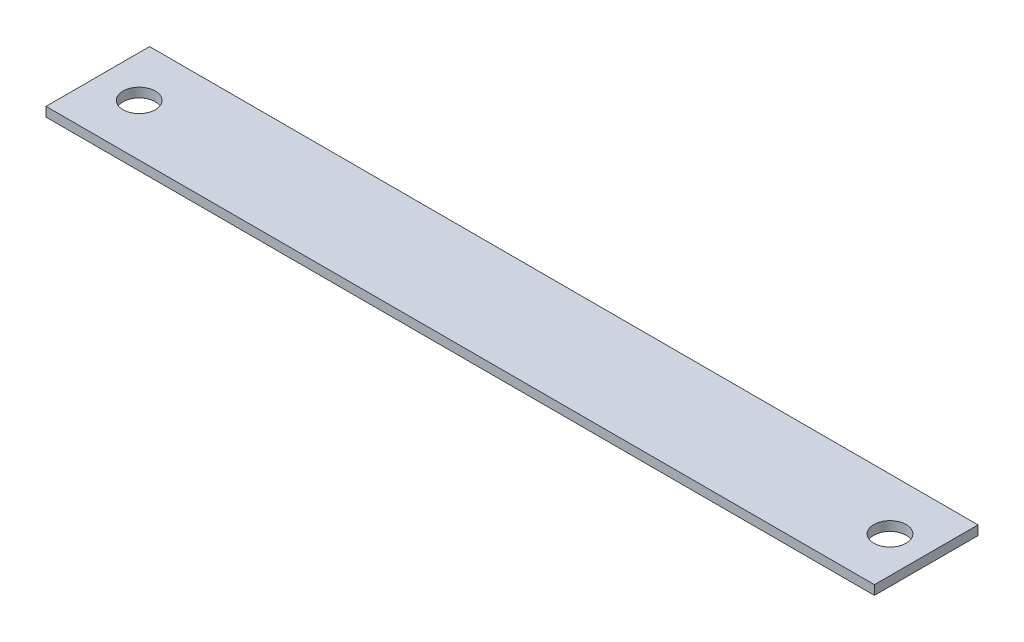
ISO-10303-21;
HEADER;
FILE_DESCRIPTION(('STEP AP214'),'2;1');
FILE_NAME('part.step','',(''),(''),'','','');
FILE_SCHEMA(('AUTOMOTIVE_DESIGN { 1 0 10303 214 1 1 1 1 }'));
ENDSEC;
DATA;
#1=APPLICATION_CONTEXT('core data for automotive mechanical design processes');
#2=APPLICATION_PROTOCOL_DEFINITION('international standard','automotive_design',2000,#1);
#3=PRODUCT_CONTEXT('',#1,'mechanical');
#4=PRODUCT('Part','Part','',(#3));
#5=PRODUCT_RELATED_PRODUCT_CATEGORY('part','',(#4));
#6=PRODUCT_DEFINITION_FORMATION('','',#4);
#7=PRODUCT_DEFINITION_CONTEXT('part definition',#1,'design');
#8=PRODUCT_DEFINITION('design','',#6,#7);
#9=PRODUCT_DEFINITION_SHAPE('','',#8);
#10=(LENGTH_UNIT() NAMED_UNIT(*) SI_UNIT(.MILLI.,.METRE.));
#11=(NAMED_UNIT(*) PLANE_ANGLE_UNIT() SI_UNIT($,.RADIAN.));
#12=(NAMED_UNIT(*) SI_UNIT($,.STERADIAN.) SOLID_ANGLE_UNIT());
#13=UNCERTAINTY_MEASURE_WITH_UNIT(LENGTH_MEASURE(1.E-05),#10,'distance_accuracy_value','');
#14=(GEOMETRIC_REPRESENTATION_CONTEXT(3) GLOBAL_UNCERTAINTY_ASSIGNED_CONTEXT((#13)) GLOBAL_UNIT_ASSIGNED_CONTEXT((#10,
#11,#12)) REPRESENTATION_CONTEXT('',''));
#15=CARTESIAN_POINT('',(0.,0.,0.));
#16=DIRECTION('',(0.,0.,1.));
#17=DIRECTION('',(1.,0.,0.));
#18=AXIS2_PLACEMENT_3D('',#15,#16,#17);
#19=CARTESIAN_POINT('',(0.,2.286,0.));
#20=DIRECTION('',(1.,0.,0.));
#21=DIRECTION('',(0.,0.,-1.));
#22=AXIS2_PLACEMENT_3D('',#19,#20,#21);
#23=PLANE('',#22);
#24=DIRECTION('',(0.,0.,1.));
#25=VECTOR('',#24,1.);
#26=CARTESIAN_POINT('',(0.,0.,0.));
#27=LINE('',#26,#25);
#28=CARTESIAN_POINT('',(0.,0.,-25.4));
#29=VERTEX_POINT('',#28);
#30=CARTESIAN_POINT('',(0.,0.,0.));
#31=VERTEX_POINT('',#30);
#32=EDGE_CURVE('E107',#29,#31,#27,.T.);
#33=ORIENTED_EDGE('',*,*,#32,.T.);
#34=DIRECTION('',(0.,-1.,0.));
#35=VECTOR('',#34,1.);
#36=CARTESIAN_POINT('',(0.,2.286,0.));
#37=LINE('',#36,#35);
#38=CARTESIAN_POINT('',(0.,2.286,0.));
#39=VERTEX_POINT('',#38);
#40=EDGE_CURVE('E11',#39,#31,#37,.T.);
#41=ORIENTED_EDGE('',*,*,#40,.F.);
#42=DIRECTION('',(0.,0.,1.));
#43=VECTOR('',#42,1.);
#44=CARTESIAN_POINT('',(0.,2.286,0.));
#45=LINE('',#44,#43);
#46=CARTESIAN_POINT('',(0.,2.286,-25.4));
#47=VERTEX_POINT('',#46);
#48=EDGE_CURVE('E91',#47,#39,#45,.T.);
#49=ORIENTED_EDGE('',*,*,#48,.F.);
#50=DIRECTION('',(0.,-1.,0.));
#51=VECTOR('',#50,1.);
#52=CARTESIAN_POINT('',(0.,2.286,-25.4));
#53=LINE('',#52,#51);
#54=EDGE_CURVE('E103',#47,#29,#53,.T.);
#55=ORIENTED_EDGE('',*,*,#54,.T.);
#56=EDGE_LOOP('',(#33,#41,#49,#55));
#57=FACE_BOUND('',#56,.T.);
#58=ADVANCED_FACE('F39',(#57),#23,.F.);
#59=CARTESIAN_POINT('',(0.,2.286,0.));
#60=DIRECTION('',(0.,0.,-1.));
#61=DIRECTION('',(-1.,0.,0.));
#62=AXIS2_PLACEMENT_3D('',#59,#60,#61);
#63=PLANE('',#62);
#64=DIRECTION('',(1.,0.,0.));
#65=VECTOR('',#64,1.);
#66=CARTESIAN_POINT('',(0.,0.,0.));
#67=LINE('',#66,#65);
#68=CARTESIAN_POINT('',(203.2,0.,0.));
#69=VERTEX_POINT('',#68);
#70=EDGE_CURVE('E96',#31,#69,#67,.T.);
#71=ORIENTED_EDGE('',*,*,#70,.T.);
#72=DIRECTION('',(0.,-1.,0.));
#73=VECTOR('',#72,1.);
#74=CARTESIAN_POINT('',(203.2,2.286,0.));
#75=LINE('',#74,#73);
#76=CARTESIAN_POINT('',(203.2,2.286,0.));
#77=VERTEX_POINT('',#76);
#78=EDGE_CURVE('E48',#77,#69,#75,.T.);
#79=ORIENTED_EDGE('',*,*,#78,.F.);
#80=DIRECTION('',(1.,0.,0.));
#81=VECTOR('',#80,1.);
#82=CARTESIAN_POINT('',(0.,2.286,0.));
#83=LINE('',#82,#81);
#84=EDGE_CURVE('E86',#39,#77,#83,.T.);
#85=ORIENTED_EDGE('',*,*,#84,.F.);
#86=ORIENTED_EDGE('',*,*,#40,.T.);
#87=EDGE_LOOP('',(#71,#79,#85,#86));
#88=FACE_BOUND('',#87,.T.);
#89=ADVANCED_FACE('F95',(#88),#63,.F.);
#90=CARTESIAN_POINT('',(203.2,2.286,0.));
#91=DIRECTION('',(-1.,0.,0.));
#92=DIRECTION('',(0.,0.,1.));
#93=AXIS2_PLACEMENT_3D('',#90,#91,#92);
#94=PLANE('',#93);
#95=DIRECTION('',(0.,0.,-1.));
#96=VECTOR('',#95,1.);
#97=CARTESIAN_POINT('',(203.2,0.,0.));
#98=LINE('',#97,#96);
#99=CARTESIAN_POINT('',(203.2,0.,-25.4));
#100=VERTEX_POINT('',#99);
#101=EDGE_CURVE('E73',#69,#100,#98,.T.);
#102=ORIENTED_EDGE('',*,*,#101,.T.);
#103=DIRECTION('',(0.,-1.,0.));
#104=VECTOR('',#103,1.);
#105=CARTESIAN_POINT('',(203.2,2.286,-25.4));
#106=LINE('',#105,#104);
#107=CARTESIAN_POINT('',(203.2,2.286,-25.4));
#108=VERTEX_POINT('',#107);
#109=EDGE_CURVE('E98',#108,#100,#106,.T.);
#110=ORIENTED_EDGE('',*,*,#109,.F.);
#111=DIRECTION('',(0.,0.,-1.));
#112=VECTOR('',#111,1.);
#113=CARTESIAN_POINT('',(203.2,2.286,0.));
#114=LINE('',#113,#112);
#115=EDGE_CURVE('E89',#77,#108,#114,.T.);
#116=ORIENTED_EDGE('',*,*,#115,.F.);
#117=ORIENTED_EDGE('',*,*,#78,.T.);
#118=EDGE_LOOP('',(#102,#110,#116,#117));
#119=FACE_BOUND('',#118,.T.);
#120=ADVANCED_FACE('F99',(#119),#94,.F.);
#121=CARTESIAN_POINT('',(0.,2.286,-25.4));
#122=DIRECTION('',(0.,0.,1.));
#123=DIRECTION('',(1.,0.,0.));
#124=AXIS2_PLACEMENT_3D('',#121,#122,#123);
#125=PLANE('',#124);
#126=DIRECTION('',(-1.,0.,0.));
#127=VECTOR('',#126,1.);
#128=CARTESIAN_POINT('',(0.,0.,-25.4));
#129=LINE('',#128,#127);
#130=EDGE_CURVE('E79',#100,#29,#129,.T.);
#131=ORIENTED_EDGE('',*,*,#130,.T.);
#132=ORIENTED_EDGE('',*,*,#54,.F.);
#133=DIRECTION('',(-1.,0.,0.));
#134=VECTOR('',#133,1.);
#135=CARTESIAN_POINT('',(0.,2.286,-25.4));
#136=LINE('',#135,#134);
#137=EDGE_CURVE('E56',#108,#47,#136,.T.);
#138=ORIENTED_EDGE('',*,*,#137,.F.);
#139=ORIENTED_EDGE('',*,*,#109,.T.);
#140=EDGE_LOOP('',(#131,#132,#138,#139));
#141=FACE_BOUND('',#140,.T.);
#142=ADVANCED_FACE('F121',(#141),#125,.F.);
#143=CARTESIAN_POINT('',(0.,2.286,0.));
#144=DIRECTION('',(0.,-1.,0.));
#145=DIRECTION('',(0.,0.,-1.));
#146=AXIS2_PLACEMENT_3D('',#143,#144,#145);
#147=PLANE('',#146);
#148=CARTESIAN_POINT('',(10.16,2.286,-12.7));
#149=DIRECTION('',(0.,1.,0.));
#150=DIRECTION('',(0.,0.,1.));
#151=AXIS2_PLACEMENT_3D('',#148,#149,#150);
#152=CIRCLE('',#151,3.96875);
#153=CARTESIAN_POINT('',(10.16,2.286,-8.73125));
#154=VERTEX_POINT('',#153);
#155=EDGE_CURVE('E136',#154,#154,#152,.T.);
#156=ORIENTED_EDGE('',*,*,#155,.F.);
#157=EDGE_LOOP('',(#156));
#158=FACE_BOUND('',#157,.T.);
#159=CARTESIAN_POINT('',(194.31,2.286,-12.7));
#160=DIRECTION('',(0.,1.,0.));
#161=DIRECTION('',(0.,0.,1.));
#162=AXIS2_PLACEMENT_3D('',#159,#160,#161);
#163=CIRCLE('',#162,3.96874999999999);
#164=CARTESIAN_POINT('',(194.31,2.286,-8.73125000000001));
#165=VERTEX_POINT('',#164);
#166=EDGE_CURVE('E128',#165,#165,#163,.T.);
#167=ORIENTED_EDGE('',*,*,#166,.F.);
#168=EDGE_LOOP('',(#167));
#169=FACE_BOUND('',#168,.T.);
#170=ORIENTED_EDGE('',*,*,#48,.T.);
#171=ORIENTED_EDGE('',*,*,#84,.T.);
#172=ORIENTED_EDGE('',*,*,#115,.T.);
#173=ORIENTED_EDGE('',*,*,#137,.T.);
#174=EDGE_LOOP('',(#170,#171,#172,#173));
#175=FACE_BOUND('',#174,.T.);
#176=ADVANCED_FACE('F87',(#158,#169,#175),#147,.F.);
#177=CARTESIAN_POINT('',(0.,0.,0.));
#178=DIRECTION('',(0.,-1.,0.));
#179=DIRECTION('',(0.,0.,-1.));
#180=AXIS2_PLACEMENT_3D('',#177,#178,#179);
#181=PLANE('',#180);
#182=CARTESIAN_POINT('',(10.16,0.,-12.7));
#183=DIRECTION('',(0.,1.,0.));
#184=DIRECTION('',(0.,0.,1.));
#185=AXIS2_PLACEMENT_3D('',#182,#183,#184);
#186=CIRCLE('',#185,3.96875);
#187=CARTESIAN_POINT('',(10.16,0.,-8.73125));
#188=VERTEX_POINT('',#187);
#189=EDGE_CURVE('E111',#188,#188,#186,.T.);
#190=ORIENTED_EDGE('',*,*,#189,.T.);
#191=EDGE_LOOP('',(#190));
#192=FACE_BOUND('',#191,.T.);
#193=CARTESIAN_POINT('',(194.31,0.,-12.7));
#194=DIRECTION('',(0.,1.,0.));
#195=DIRECTION('',(0.,0.,1.));
#196=AXIS2_PLACEMENT_3D('',#193,#194,#195);
#197=CIRCLE('',#196,3.96874999999999);
#198=CARTESIAN_POINT('',(194.31,0.,-8.73125000000001));
#199=VERTEX_POINT('',#198);
#200=EDGE_CURVE('E132',#199,#199,#197,.T.);
#201=ORIENTED_EDGE('',*,*,#200,.T.);
#202=EDGE_LOOP('',(#201));
#203=FACE_BOUND('',#202,.T.);
#204=ORIENTED_EDGE('',*,*,#32,.F.);
#205=ORIENTED_EDGE('',*,*,#130,.F.);
#206=ORIENTED_EDGE('',*,*,#101,.F.);
#207=ORIENTED_EDGE('',*,*,#70,.F.);
#208=EDGE_LOOP('',(#204,#205,#206,#207));
#209=FACE_BOUND('',#208,.T.);
#210=ADVANCED_FACE('F124',(#192,#203,#209),#181,.T.);
#211=CARTESIAN_POINT('',(194.31,0.,-12.7));
#212=DIRECTION('',(0.,1.,0.));
#213=DIRECTION('',(0.,0.,1.));
#214=AXIS2_PLACEMENT_3D('',#211,#212,#213);
#215=CYLINDRICAL_SURFACE('',#214,3.96874999999999);
#216=ORIENTED_EDGE('',*,*,#200,.F.);
#217=EDGE_LOOP('',(#216));
#218=FACE_BOUND('',#217,.T.);
#219=ORIENTED_EDGE('',*,*,#166,.T.);
#220=EDGE_LOOP('',(#219));
#221=FACE_BOUND('',#220,.T.);
#222=ADVANCED_FACE('F149',(#218,#221),#215,.F.);
#223=CARTESIAN_POINT('',(10.16,0.,-12.7));
#224=DIRECTION('',(0.,1.,0.));
#225=DIRECTION('',(0.,0.,1.));
#226=AXIS2_PLACEMENT_3D('',#223,#224,#225);
#227=CYLINDRICAL_SURFACE('',#226,3.96875);
#228=ORIENTED_EDGE('',*,*,#189,.F.);
#229=EDGE_LOOP('',(#228));
#230=FACE_BOUND('',#229,.T.);
#231=ORIENTED_EDGE('',*,*,#155,.T.);
#232=EDGE_LOOP('',(#231));
#233=FACE_BOUND('',#232,.T.);
#234=ADVANCED_FACE('F146',(#230,#233),#227,.F.);
#235=CLOSED_SHELL('',(#58,#89,#120,#142,#176,#210,#222,#234));
#236=MANIFOLD_SOLID_BREP('B2',#235);
#237=ADVANCED_BREP_SHAPE_REPRESENTATION('',(#18,#236),#14);
#238=SHAPE_DEFINITION_REPRESENTATION(#9,#237);
ENDSEC;
END-ISO-10303-21;
